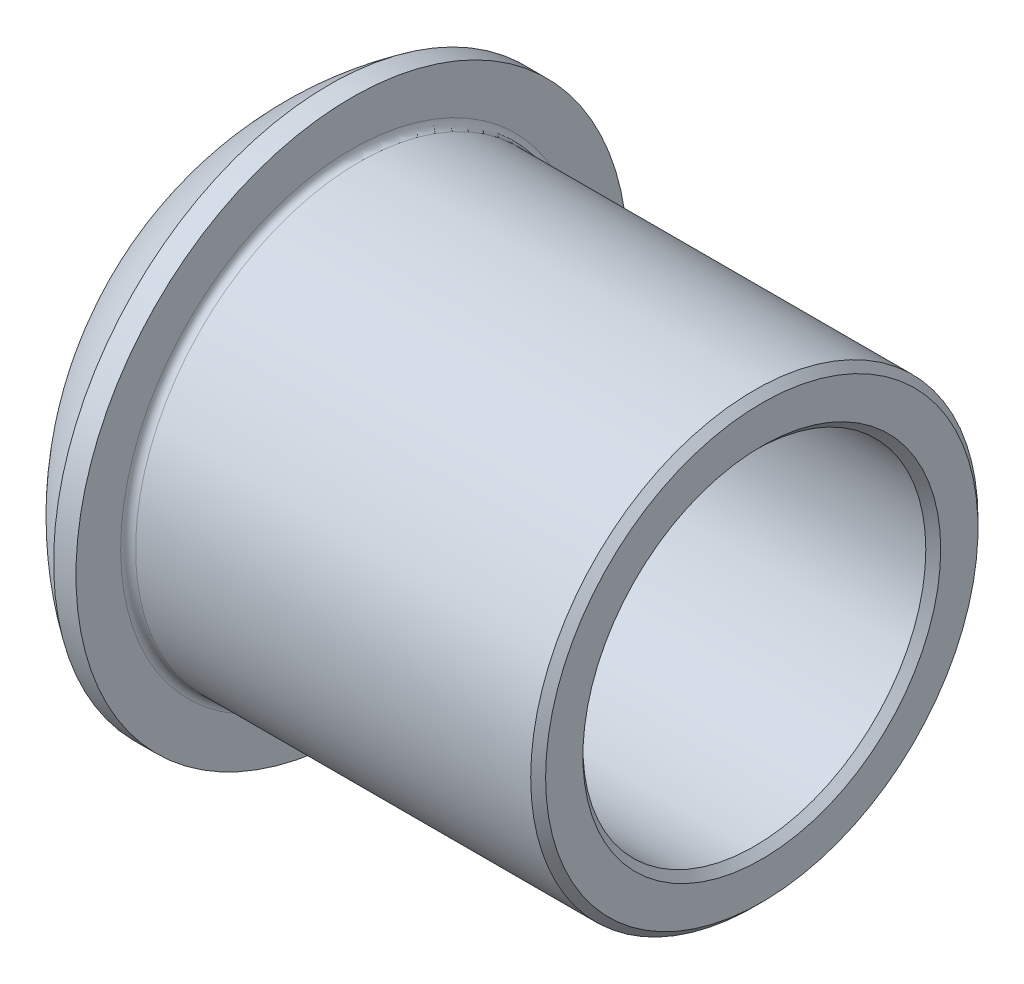
ISO-10303-21;
HEADER;
FILE_DESCRIPTION(('STEP AP214'),'2;1');
FILE_NAME('part.step','',(''),(''),'','','');
FILE_SCHEMA(('AUTOMOTIVE_DESIGN { 1 0 10303 214 1 1 1 1 }'));
ENDSEC;
DATA;
#1=APPLICATION_CONTEXT('core data for automotive mechanical design processes');
#2=APPLICATION_PROTOCOL_DEFINITION('international standard','automotive_design',2000,#1);
#3=PRODUCT_CONTEXT('',#1,'mechanical');
#4=PRODUCT('Part','Part','',(#3));
#5=PRODUCT_RELATED_PRODUCT_CATEGORY('part','',(#4));
#6=PRODUCT_DEFINITION_FORMATION('','',#4);
#7=PRODUCT_DEFINITION_CONTEXT('part definition',#1,'design');
#8=PRODUCT_DEFINITION('design','',#6,#7);
#9=PRODUCT_DEFINITION_SHAPE('','',#8);
#10=(LENGTH_UNIT() NAMED_UNIT(*) SI_UNIT(.MILLI.,.METRE.));
#11=(NAMED_UNIT(*) PLANE_ANGLE_UNIT() SI_UNIT($,.RADIAN.));
#12=(NAMED_UNIT(*) SI_UNIT($,.STERADIAN.) SOLID_ANGLE_UNIT());
#13=UNCERTAINTY_MEASURE_WITH_UNIT(LENGTH_MEASURE(1.E-05),#10,'distance_accuracy_value','');
#14=(GEOMETRIC_REPRESENTATION_CONTEXT(3) GLOBAL_UNCERTAINTY_ASSIGNED_CONTEXT((#13)) GLOBAL_UNIT_ASSIGNED_CONTEXT((#10,
#11,#12)) REPRESENTATION_CONTEXT('',''));
#15=CARTESIAN_POINT('',(0.,0.,0.));
#16=DIRECTION('',(0.,0.,1.));
#17=DIRECTION('',(1.,0.,0.));
#18=AXIS2_PLACEMENT_3D('',#15,#16,#17);
#19=CARTESIAN_POINT('',(-7.3,1.8,0.));
#20=DIRECTION('',(-1.,0.,0.));
#21=DIRECTION('',(0.,0.,1.));
#22=AXIS2_PLACEMENT_3D('',#19,#20,#21);
#23=PLANE('',#22);
#24=CARTESIAN_POINT('',(-7.3,0.,0.));
#25=DIRECTION('',(1.,0.,0.));
#26=DIRECTION('',(0.,0.,-1.));
#27=AXIS2_PLACEMENT_3D('',#24,#25,#26);
#28=CIRCLE('',#27,1.8);
#29=CARTESIAN_POINT('',(-7.3,0.,-1.8));
#30=VERTEX_POINT('',#29);
#31=EDGE_CURVE('E92',#30,#30,#28,.T.);
#32=ORIENTED_EDGE('',*,*,#31,.F.);
#33=EDGE_LOOP('',(#32));
#34=FACE_BOUND('',#33,.T.);
#35=ADVANCED_FACE('F17',(#34),#23,.T.);
#36=CARTESIAN_POINT('',(-6.,2.3,0.));
#37=DIRECTION('',(1.,0.,0.));
#38=DIRECTION('',(0.,0.,-1.));
#39=AXIS2_PLACEMENT_3D('',#36,#37,#38);
#40=PLANE('',#39);
#41=CARTESIAN_POINT('',(-6.,0.,0.));
#42=DIRECTION('',(1.,0.,0.));
#43=DIRECTION('',(0.,0.,-1.));
#44=AXIS2_PLACEMENT_3D('',#41,#42,#43);
#45=CIRCLE('',#44,2.3);
#46=CARTESIAN_POINT('',(-6.,0.,-2.3));
#47=VERTEX_POINT('',#46);
#48=EDGE_CURVE('E88',#47,#47,#45,.T.);
#49=ORIENTED_EDGE('',*,*,#48,.T.);
#50=EDGE_LOOP('',(#49));
#51=FACE_BOUND('',#50,.T.);
#52=ADVANCED_FACE('F100',(#51),#40,.T.);
#53=CARTESIAN_POINT('',(-3.55765054011026,0.,-0.387618847455471));
#54=DIRECTION('',(0.,1.,0.));
#55=DIRECTION('',(0.,0.,-1.));
#56=AXIS2_PLACEMENT_3D('',#53,#54,#55);
#57=CIRCLE('',#56,4.);
#58=TRIMMED_CURVE('',#57,(PARAMETER_VALUE(-1.66785334748132)),
(PARAMETER_VALUE(1.66785334748132)),.T.,.PARAMETER.);
#59=CARTESIAN_POINT('',(-3.55765054011026,0.,0.));
#60=DIRECTION('',(1.,0.,0.));
#61=AXIS1_PLACEMENT('',#59,#60);
#62=SURFACE_OF_REVOLUTION('',#58,#61);
#63=ORIENTED_EDGE('',*,*,#31,.T.);
#64=EDGE_LOOP('',(#63));
#65=FACE_BOUND('',#64,.T.);
#66=CARTESIAN_POINT('',(-5.8,0.,0.));
#67=DIRECTION('',(1.,0.,0.));
#68=DIRECTION('',(0.,0.,-1.));
#69=AXIS2_PLACEMENT_3D('',#66,#67,#68);
#70=CIRCLE('',#69,3.7);
#71=CARTESIAN_POINT('',(-5.8,0.,-3.7));
#72=VERTEX_POINT('',#71);
#73=EDGE_CURVE('E91',#72,#72,#70,.T.);
#74=ORIENTED_EDGE('',*,*,#73,.F.);
#75=EDGE_LOOP('',(#74));
#76=FACE_BOUND('',#75,.T.);
#77=ADVANCED_FACE('F96',(#65,#76),#62,.F.);
#78=CARTESIAN_POINT('',(0.,0.,0.));
#79=DIRECTION('',(1.,0.,0.));
#80=DIRECTION('',(0.,0.,-1.));
#81=AXIS2_PLACEMENT_3D('',#78,#79,#80);
#82=CYLINDRICAL_SURFACE('',#81,2.3);
#83=CARTESIAN_POINT('',(-0.0999999999748979,0.,0.));
#84=DIRECTION('',(1.,0.,0.));
#85=DIRECTION('',(0.,0.,-1.));
#86=AXIS2_PLACEMENT_3D('',#83,#84,#85);
#87=CIRCLE('',#86,2.29999999999109);
#88=CARTESIAN_POINT('',(-0.0999999999748979,0.,-2.29999999999109));
#89=VERTEX_POINT('',#88);
#90=EDGE_CURVE('E55',#89,#89,#87,.T.);
#91=ORIENTED_EDGE('',*,*,#90,.T.);
#92=EDGE_LOOP('',(#91));
#93=FACE_BOUND('',#92,.T.);
#94=ORIENTED_EDGE('',*,*,#48,.F.);
#95=EDGE_LOOP('',(#94));
#96=FACE_BOUND('',#95,.T.);
#97=ADVANCED_FACE('F149',(#93,#96),#82,.F.);
#98=CARTESIAN_POINT('',(0.,0.,0.));
#99=DIRECTION('',(1.,0.,0.));
#100=DIRECTION('',(0.,0.,-1.));
#101=AXIS2_PLACEMENT_3D('',#98,#99,#100);
#102=CYLINDRICAL_SURFACE('',#101,3.7);
#103=ORIENTED_EDGE('',*,*,#73,.T.);
#104=EDGE_LOOP('',(#103));
#105=FACE_BOUND('',#104,.T.);
#106=CARTESIAN_POINT('',(-5.5,0.,0.));
#107=DIRECTION('',(1.,0.,0.));
#108=DIRECTION('',(0.,0.,-1.));
#109=AXIS2_PLACEMENT_3D('',#106,#107,#108);
#110=CIRCLE('',#109,3.7);
#111=CARTESIAN_POINT('',(-5.5,0.,-3.7));
#112=VERTEX_POINT('',#111);
#113=EDGE_CURVE('E85',#112,#112,#110,.T.);
#114=ORIENTED_EDGE('',*,*,#113,.F.);
#115=EDGE_LOOP('',(#114));
#116=FACE_BOUND('',#115,.T.);
#117=ADVANCED_FACE('F141',(#105,#116),#102,.T.);
#118=CARTESIAN_POINT('',(5.6843418860808E-11,0.,0.));
#119=DIRECTION('',(1.,0.,0.));
#120=DIRECTION('',(0.,0.,-1.));
#121=AXIS2_PLACEMENT_3D('',#118,#119,#120);
#122=CONICAL_SURFACE('',#121,2.40000000002283,0.785398163113231);
#123=CARTESIAN_POINT('',(5.6843418860808E-11,0.,0.));
#124=DIRECTION('',(1.,0.,0.));
#125=DIRECTION('',(0.,0.,-1.));
#126=AXIS2_PLACEMENT_3D('',#123,#124,#125);
#127=CIRCLE('',#126,2.40000000002283);
#128=CARTESIAN_POINT('',(5.6843418860808E-11,0.,-2.40000000002283));
#129=VERTEX_POINT('',#128);
#130=EDGE_CURVE('E41',#129,#129,#127,.F.);
#131=ORIENTED_EDGE('',*,*,#130,.F.);
#132=EDGE_LOOP('',(#131));
#133=FACE_BOUND('',#132,.T.);
#134=ORIENTED_EDGE('',*,*,#90,.F.);
#135=EDGE_LOOP('',(#134));
#136=FACE_BOUND('',#135,.T.);
#137=ADVANCED_FACE('F134',(#133,#136),#122,.F.);
#138=CARTESIAN_POINT('',(-5.5,3.,0.));
#139=DIRECTION('',(1.,0.,0.));
#140=DIRECTION('',(0.,0.,-1.));
#141=AXIS2_PLACEMENT_3D('',#138,#139,#140);
#142=PLANE('',#141);
#143=ORIENTED_EDGE('',*,*,#113,.T.);
#144=EDGE_LOOP('',(#143));
#145=FACE_BOUND('',#144,.T.);
#146=CARTESIAN_POINT('',(-5.5,0.,0.));
#147=DIRECTION('',(1.,0.,0.));
#148=DIRECTION('',(0.,0.,1.));
#149=AXIS2_PLACEMENT_3D('',#146,#147,#148);
#150=CIRCLE('',#149,3.1);
#151=CARTESIAN_POINT('',(-5.5,0.,-3.1));
#152=VERTEX_POINT('',#151);
#153=CARTESIAN_POINT('',(-5.5,0.,3.1));
#154=VERTEX_POINT('',#153);
#155=EDGE_CURVE('E37',#152,#154,#150,.F.);
#156=ORIENTED_EDGE('',*,*,#155,.T.);
#157=CARTESIAN_POINT('',(-5.5,0.,0.));
#158=DIRECTION('',(1.,0.,0.));
#159=DIRECTION('',(0.,0.,-1.));
#160=AXIS2_PLACEMENT_3D('',#157,#158,#159);
#161=CIRCLE('',#160,3.1);
#162=EDGE_CURVE('E34',#154,#152,#161,.F.);
#163=ORIENTED_EDGE('',*,*,#162,.T.);
#164=EDGE_LOOP('',(#156,#163));
#165=FACE_BOUND('',#164,.T.);
#166=ADVANCED_FACE('F39',(#145,#165),#142,.T.);
#167=CARTESIAN_POINT('',(0.,2.4,0.));
#168=DIRECTION('',(1.,0.,0.));
#169=DIRECTION('',(0.,0.,-1.));
#170=AXIS2_PLACEMENT_3D('',#167,#168,#169);
#171=PLANE('',#170);
#172=ORIENTED_EDGE('',*,*,#130,.T.);
#173=EDGE_LOOP('',(#172));
#174=FACE_BOUND('',#173,.T.);
#175=CARTESIAN_POINT('',(5.6843418860808E-11,0.,0.));
#176=DIRECTION('',(-1.,0.,0.));
#177=DIRECTION('',(0.,0.,1.));
#178=AXIS2_PLACEMENT_3D('',#175,#176,#177);
#179=CIRCLE('',#178,2.89999999995416);
#180=CARTESIAN_POINT('',(5.6843418860808E-11,0.,2.89999999995416));
#181=VERTEX_POINT('',#180);
#182=EDGE_CURVE('E46',#181,#181,#179,.T.);
#183=ORIENTED_EDGE('',*,*,#182,.F.);
#184=EDGE_LOOP('',(#183));
#185=FACE_BOUND('',#184,.T.);
#186=ADVANCED_FACE('F67',(#174,#185),#171,.T.);
#187=CARTESIAN_POINT('',(-5.4,0.,0.));
#188=DIRECTION('',(1.,0.,0.));
#189=DIRECTION('',(0.,0.,-1.));
#190=AXIS2_PLACEMENT_3D('',#187,#188,#189);
#191=TOROIDAL_SURFACE('',#190,3.1,0.1);
#192=CARTESIAN_POINT('',(-5.4,0.,0.));
#193=DIRECTION('',(1.,0.,0.));
#194=DIRECTION('',(0.,0.,-1.));
#195=AXIS2_PLACEMENT_3D('',#192,#193,#194);
#196=CIRCLE('',#195,3.);
#197=CARTESIAN_POINT('',(-5.4,0.,-3.));
#198=VERTEX_POINT('',#197);
#199=EDGE_CURVE('E27',#198,#198,#196,.T.);
#200=ORIENTED_EDGE('',*,*,#199,.F.);
#201=EDGE_LOOP('',(#200));
#202=FACE_BOUND('',#201,.T.);
#203=ORIENTED_EDGE('',*,*,#155,.F.);
#204=ORIENTED_EDGE('',*,*,#162,.F.);
#205=EDGE_LOOP('',(#203,#204));
#206=FACE_BOUND('',#205,.T.);
#207=ADVANCED_FACE('F45',(#202,#206),#191,.F.);
#208=CARTESIAN_POINT('',(-0.0999999999180545,0.,0.));
#209=DIRECTION('',(-1.,0.,0.));
#210=DIRECTION('',(0.,0.,1.));
#211=AXIS2_PLACEMENT_3D('',#208,#209,#210);
#212=CONICAL_SURFACE('',#211,2.99999999987222,0.785398163113231);
#213=CARTESIAN_POINT('',(-0.1,0.,0.));
#214=DIRECTION('',(1.,0.,0.));
#215=DIRECTION('',(0.,0.,-1.));
#216=AXIS2_PLACEMENT_3D('',#213,#214,#215);
#217=CIRCLE('',#216,3.);
#218=CARTESIAN_POINT('',(-0.1,0.,-3.));
#219=VERTEX_POINT('',#218);
#220=EDGE_CURVE('E11',#219,#219,#217,.F.);
#221=ORIENTED_EDGE('',*,*,#220,.F.);
#222=EDGE_LOOP('',(#221));
#223=FACE_BOUND('',#222,.T.);
#224=ORIENTED_EDGE('',*,*,#182,.T.);
#225=EDGE_LOOP('',(#224));
#226=FACE_BOUND('',#225,.T.);
#227=ADVANCED_FACE('F66',(#223,#226),#212,.T.);
#228=CARTESIAN_POINT('',(0.,0.,0.));
#229=DIRECTION('',(1.,0.,0.));
#230=DIRECTION('',(0.,0.,-1.));
#231=AXIS2_PLACEMENT_3D('',#228,#229,#230);
#232=CYLINDRICAL_SURFACE('',#231,3.);
#233=ORIENTED_EDGE('',*,*,#220,.T.);
#234=EDGE_LOOP('',(#233));
#235=FACE_BOUND('',#234,.T.);
#236=ORIENTED_EDGE('',*,*,#199,.T.);
#237=EDGE_LOOP('',(#236));
#238=FACE_BOUND('',#237,.T.);
#239=ADVANCED_FACE('F106',(#235,#238),#232,.T.);
#240=CLOSED_SHELL('',(#35,#52,#77,#97,#117,#137,#166,#186,#207,#227,#239));
#241=MANIFOLD_SOLID_BREP('B1',#240);
#242=ADVANCED_BREP_SHAPE_REPRESENTATION('',(#18,#241),#14);
#243=SHAPE_DEFINITION_REPRESENTATION(#9,#242);
ENDSEC;
END-ISO-10303-21;
